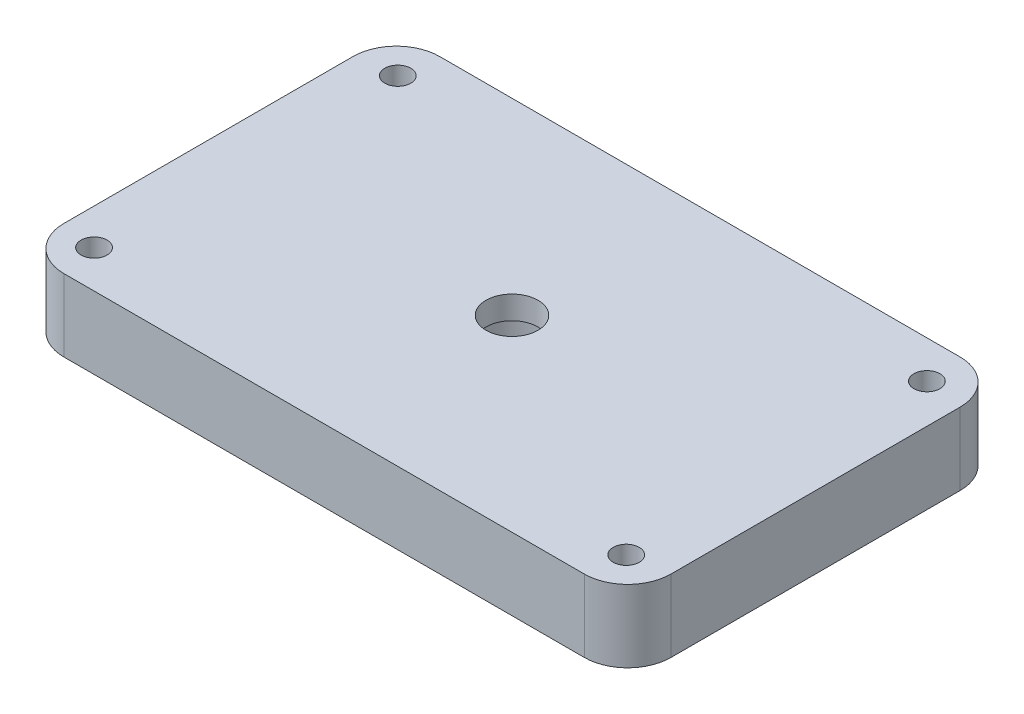
ISO-10303-21;
HEADER;
FILE_DESCRIPTION(('STEP AP214'),'2;1');
FILE_NAME('part.step','',(''),(''),'','','');
FILE_SCHEMA(('AUTOMOTIVE_DESIGN { 1 0 10303 214 1 1 1 1 }'));
ENDSEC;
DATA;
#1=APPLICATION_CONTEXT('core data for automotive mechanical design processes');
#2=APPLICATION_PROTOCOL_DEFINITION('international standard','automotive_design',2000,#1);
#3=PRODUCT_CONTEXT('',#1,'mechanical');
#4=PRODUCT('Part','Part','',(#3));
#5=PRODUCT_RELATED_PRODUCT_CATEGORY('part','',(#4));
#6=PRODUCT_DEFINITION_FORMATION('','',#4);
#7=PRODUCT_DEFINITION_CONTEXT('part definition',#1,'design');
#8=PRODUCT_DEFINITION('design','',#6,#7);
#9=PRODUCT_DEFINITION_SHAPE('','',#8);
#10=(LENGTH_UNIT() NAMED_UNIT(*) SI_UNIT(.MILLI.,.METRE.));
#11=(NAMED_UNIT(*) PLANE_ANGLE_UNIT() SI_UNIT($,.RADIAN.));
#12=(NAMED_UNIT(*) SI_UNIT($,.STERADIAN.) SOLID_ANGLE_UNIT());
#13=UNCERTAINTY_MEASURE_WITH_UNIT(LENGTH_MEASURE(1.E-05),#10,'distance_accuracy_value','');
#14=(GEOMETRIC_REPRESENTATION_CONTEXT(3) GLOBAL_UNCERTAINTY_ASSIGNED_CONTEXT((#13)) GLOBAL_UNIT_ASSIGNED_CONTEXT((#10,
#11,#12)) REPRESENTATION_CONTEXT('',''));
#15=CARTESIAN_POINT('',(0.,0.,0.));
#16=DIRECTION('',(0.,0.,1.));
#17=DIRECTION('',(1.,0.,0.));
#18=AXIS2_PLACEMENT_3D('',#15,#16,#17);
#19=CARTESIAN_POINT('',(-22.86,6.35,-12.7));
#20=DIRECTION('',(0.,1.,0.));
#21=DIRECTION('',(0.,0.,1.));
#22=AXIS2_PLACEMENT_3D('',#19,#20,#21);
#23=PLANE('',#22);
#24=CARTESIAN_POINT('',(0.,6.35,0.));
#25=DIRECTION('',(0.,1.,0.));
#26=DIRECTION('',(0.,0.,1.));
#27=AXIS2_PLACEMENT_3D('',#24,#25,#26);
#28=CIRCLE('',#27,2.286);
#29=CARTESIAN_POINT('',(0.,6.35,2.286));
#30=VERTEX_POINT('',#29);
#31=EDGE_CURVE('E208',#30,#30,#28,.T.);
#32=ORIENTED_EDGE('',*,*,#31,.F.);
#33=EDGE_LOOP('',(#32));
#34=FACE_BOUND('',#33,.T.);
#35=CARTESIAN_POINT('',(23.241,6.35,13.208));
#36=DIRECTION('',(0.,1.,0.));
#37=DIRECTION('',(0.,0.,1.));
#38=AXIS2_PLACEMENT_3D('',#35,#36,#37);
#39=CIRCLE('',#38,1.14299999999999);
#40=CARTESIAN_POINT('',(23.241,6.35,14.351));
#41=VERTEX_POINT('',#40);
#42=EDGE_CURVE('E190',#41,#41,#39,.T.);
#43=ORIENTED_EDGE('',*,*,#42,.F.);
#44=EDGE_LOOP('',(#43));
#45=FACE_BOUND('',#44,.T.);
#46=CARTESIAN_POINT('',(-23.241,6.35,-13.208));
#47=DIRECTION('',(0.,1.,0.));
#48=DIRECTION('',(0.,0.,1.));
#49=AXIS2_PLACEMENT_3D('',#46,#47,#48);
#50=CIRCLE('',#49,1.143);
#51=CARTESIAN_POINT('',(-23.241,6.35,-12.065));
#52=VERTEX_POINT('',#51);
#53=EDGE_CURVE('E136',#52,#52,#50,.T.);
#54=ORIENTED_EDGE('',*,*,#53,.F.);
#55=EDGE_LOOP('',(#54));
#56=FACE_BOUND('',#55,.T.);
#57=CARTESIAN_POINT('',(-22.86,6.35,-12.7));
#58=DIRECTION('',(0.,1.,0.));
#59=DIRECTION('',(0.,0.,1.));
#60=AXIS2_PLACEMENT_3D('',#57,#58,#59);
#61=CIRCLE('',#60,3.81);
#62=CARTESIAN_POINT('',(-22.86,6.35,-16.51));
#63=VERTEX_POINT('',#62);
#64=CARTESIAN_POINT('',(-26.67,6.35,-12.7));
#65=VERTEX_POINT('',#64);
#66=EDGE_CURVE('E148',#63,#65,#61,.T.);
#67=ORIENTED_EDGE('',*,*,#66,.T.);
#68=DIRECTION('',(0.,0.,1.));
#69=VECTOR('',#68,1.);
#70=CARTESIAN_POINT('',(-26.67,6.35,-12.7));
#71=LINE('',#70,#69);
#72=CARTESIAN_POINT('',(-26.67,6.35,12.7));
#73=VERTEX_POINT('',#72);
#74=EDGE_CURVE('E95',#65,#73,#71,.T.);
#75=ORIENTED_EDGE('',*,*,#74,.T.);
#76=CARTESIAN_POINT('',(-22.86,6.35,12.7));
#77=DIRECTION('',(0.,1.,0.));
#78=DIRECTION('',(0.,0.,1.));
#79=AXIS2_PLACEMENT_3D('',#76,#77,#78);
#80=CIRCLE('',#79,3.81);
#81=CARTESIAN_POINT('',(-22.86,6.35,16.51));
#82=VERTEX_POINT('',#81);
#83=EDGE_CURVE('E163',#73,#82,#80,.T.);
#84=ORIENTED_EDGE('',*,*,#83,.T.);
#85=DIRECTION('',(1.,0.,0.));
#86=VECTOR('',#85,1.);
#87=CARTESIAN_POINT('',(-22.86,6.35,16.51));
#88=LINE('',#87,#86);
#89=CARTESIAN_POINT('',(22.86,6.35,16.51));
#90=VERTEX_POINT('',#89);
#91=EDGE_CURVE('E175',#82,#90,#88,.T.);
#92=ORIENTED_EDGE('',*,*,#91,.T.);
#93=CARTESIAN_POINT('',(22.86,6.35,12.7));
#94=DIRECTION('',(0.,1.,0.));
#95=DIRECTION('',(0.,0.,1.));
#96=AXIS2_PLACEMENT_3D('',#93,#94,#95);
#97=CIRCLE('',#96,3.81);
#98=CARTESIAN_POINT('',(26.67,6.35,12.7));
#99=VERTEX_POINT('',#98);
#100=EDGE_CURVE('E114',#90,#99,#97,.T.);
#101=ORIENTED_EDGE('',*,*,#100,.T.);
#102=DIRECTION('',(0.,0.,-1.));
#103=VECTOR('',#102,1.);
#104=CARTESIAN_POINT('',(26.67,6.35,-12.7));
#105=LINE('',#104,#103);
#106=CARTESIAN_POINT('',(26.67,6.35,-12.7));
#107=VERTEX_POINT('',#106);
#108=EDGE_CURVE('E108',#99,#107,#105,.T.);
#109=ORIENTED_EDGE('',*,*,#108,.T.);
#110=CARTESIAN_POINT('',(22.86,6.35,-12.7));
#111=DIRECTION('',(0.,1.,0.));
#112=DIRECTION('',(0.,0.,-1.));
#113=AXIS2_PLACEMENT_3D('',#110,#111,#112);
#114=CIRCLE('',#113,3.81);
#115=CARTESIAN_POINT('',(22.86,6.35,-16.51));
#116=VERTEX_POINT('',#115);
#117=EDGE_CURVE('E112',#107,#116,#114,.T.);
#118=ORIENTED_EDGE('',*,*,#117,.T.);
#119=DIRECTION('',(-1.,0.,0.));
#120=VECTOR('',#119,1.);
#121=CARTESIAN_POINT('',(-22.86,6.35,-16.51));
#122=LINE('',#121,#120);
#123=EDGE_CURVE('E52',#116,#63,#122,.T.);
#124=ORIENTED_EDGE('',*,*,#123,.T.);
#125=EDGE_LOOP('',(#67,#75,#84,#92,#101,#109,#118,#124));
#126=FACE_BOUND('',#125,.T.);
#127=CARTESIAN_POINT('',(23.241,6.35,-13.208));
#128=DIRECTION('',(0.,1.,0.));
#129=DIRECTION('',(0.,0.,1.));
#130=AXIS2_PLACEMENT_3D('',#127,#128,#129);
#131=CIRCLE('',#130,1.143);
#132=CARTESIAN_POINT('',(23.241,6.35,-12.065));
#133=VERTEX_POINT('',#132);
#134=EDGE_CURVE('E184',#133,#133,#131,.T.);
#135=ORIENTED_EDGE('',*,*,#134,.F.);
#136=EDGE_LOOP('',(#135));
#137=FACE_BOUND('',#136,.T.);
#138=CARTESIAN_POINT('',(-23.5075398103486,6.35,13.208));
#139=DIRECTION('',(0.,1.,0.));
#140=DIRECTION('',(0.,0.,1.));
#141=AXIS2_PLACEMENT_3D('',#138,#139,#140);
#142=CIRCLE('',#141,1.143);
#143=CARTESIAN_POINT('',(-23.5075398103486,6.35,14.351));
#144=VERTEX_POINT('',#143);
#145=EDGE_CURVE('E196',#144,#144,#142,.T.);
#146=ORIENTED_EDGE('',*,*,#145,.F.);
#147=EDGE_LOOP('',(#146));
#148=FACE_BOUND('',#147,.T.);
#149=ADVANCED_FACE('F35',(#34,#45,#56,#126,#137,#148),#23,.T.);
#150=CARTESIAN_POINT('',(-22.86,0.,-12.7));
#151=DIRECTION('',(0.,1.,0.));
#152=DIRECTION('',(0.,0.,1.));
#153=AXIS2_PLACEMENT_3D('',#150,#151,#152);
#154=PLANE('',#153);
#155=CARTESIAN_POINT('',(0.,0.,0.));
#156=DIRECTION('',(0.,-1.,0.));
#157=DIRECTION('',(0.,0.,-1.));
#158=AXIS2_PLACEMENT_3D('',#155,#156,#157);
#159=CIRCLE('',#158,3.81);
#160=CARTESIAN_POINT('',(0.,0.,-3.81));
#161=VERTEX_POINT('',#160);
#162=EDGE_CURVE('E205',#161,#161,#159,.T.);
#163=ORIENTED_EDGE('',*,*,#162,.F.);
#164=EDGE_LOOP('',(#163));
#165=FACE_BOUND('',#164,.T.);
#166=CARTESIAN_POINT('',(-22.86,0.,-12.7));
#167=DIRECTION('',(0.,1.,0.));
#168=DIRECTION('',(0.,0.,1.));
#169=AXIS2_PLACEMENT_3D('',#166,#167,#168);
#170=CIRCLE('',#169,3.81);
#171=CARTESIAN_POINT('',(-22.86,0.,-16.51));
#172=VERTEX_POINT('',#171);
#173=CARTESIAN_POINT('',(-26.67,0.,-12.7));
#174=VERTEX_POINT('',#173);
#175=EDGE_CURVE('E132',#172,#174,#170,.T.);
#176=ORIENTED_EDGE('',*,*,#175,.F.);
#177=DIRECTION('',(-1.,0.,0.));
#178=VECTOR('',#177,1.);
#179=CARTESIAN_POINT('',(-22.86,0.,-16.51));
#180=LINE('',#179,#178);
#181=CARTESIAN_POINT('',(22.86,0.,-16.51));
#182=VERTEX_POINT('',#181);
#183=EDGE_CURVE('E87',#182,#172,#180,.T.);
#184=ORIENTED_EDGE('',*,*,#183,.F.);
#185=CARTESIAN_POINT('',(22.86,0.,-12.7));
#186=DIRECTION('',(0.,1.,0.));
#187=DIRECTION('',(0.,0.,-1.));
#188=AXIS2_PLACEMENT_3D('',#185,#186,#187);
#189=CIRCLE('',#188,3.81);
#190=CARTESIAN_POINT('',(26.67,0.,-12.7));
#191=VERTEX_POINT('',#190);
#192=EDGE_CURVE('E81',#191,#182,#189,.T.);
#193=ORIENTED_EDGE('',*,*,#192,.F.);
#194=DIRECTION('',(0.,0.,-1.));
#195=VECTOR('',#194,1.);
#196=CARTESIAN_POINT('',(26.67,0.,-12.7));
#197=LINE('',#196,#195);
#198=CARTESIAN_POINT('',(26.67,0.,12.7));
#199=VERTEX_POINT('',#198);
#200=EDGE_CURVE('E122',#199,#191,#197,.T.);
#201=ORIENTED_EDGE('',*,*,#200,.F.);
#202=CARTESIAN_POINT('',(22.86,0.,12.7));
#203=DIRECTION('',(0.,1.,0.));
#204=DIRECTION('',(0.,0.,1.));
#205=AXIS2_PLACEMENT_3D('',#202,#203,#204);
#206=CIRCLE('',#205,3.81);
#207=CARTESIAN_POINT('',(22.86,0.,16.51));
#208=VERTEX_POINT('',#207);
#209=EDGE_CURVE('E143',#208,#199,#206,.T.);
#210=ORIENTED_EDGE('',*,*,#209,.F.);
#211=DIRECTION('',(1.,0.,0.));
#212=VECTOR('',#211,1.);
#213=CARTESIAN_POINT('',(18.7325,0.,16.51));
#214=LINE('',#213,#212);
#215=CARTESIAN_POINT('',(-22.86,0.,16.51));
#216=VERTEX_POINT('',#215);
#217=EDGE_CURVE('E141',#216,#208,#214,.T.);
#218=ORIENTED_EDGE('',*,*,#217,.F.);
#219=CARTESIAN_POINT('',(-22.86,0.,12.7));
#220=DIRECTION('',(0.,1.,0.));
#221=DIRECTION('',(0.,0.,1.));
#222=AXIS2_PLACEMENT_3D('',#219,#220,#221);
#223=CIRCLE('',#222,3.81);
#224=CARTESIAN_POINT('',(-26.67,0.,12.7));
#225=VERTEX_POINT('',#224);
#226=EDGE_CURVE('E138',#225,#216,#223,.T.);
#227=ORIENTED_EDGE('',*,*,#226,.F.);
#228=DIRECTION('',(0.,0.,1.));
#229=VECTOR('',#228,1.);
#230=CARTESIAN_POINT('',(-26.67,0.,-12.7));
#231=LINE('',#230,#229);
#232=EDGE_CURVE('E135',#174,#225,#231,.T.);
#233=ORIENTED_EDGE('',*,*,#232,.F.);
#234=EDGE_LOOP('',(#176,#184,#193,#201,#210,#218,#227,#233));
#235=FACE_BOUND('',#234,.T.);
#236=CARTESIAN_POINT('',(-23.241,0.,-13.208));
#237=DIRECTION('',(0.,1.,0.));
#238=DIRECTION('',(0.,0.,1.));
#239=AXIS2_PLACEMENT_3D('',#236,#237,#238);
#240=CIRCLE('',#239,1.143);
#241=CARTESIAN_POINT('',(-23.241,0.,-12.065));
#242=VERTEX_POINT('',#241);
#243=EDGE_CURVE('E181',#242,#242,#240,.T.);
#244=ORIENTED_EDGE('',*,*,#243,.T.);
#245=EDGE_LOOP('',(#244));
#246=FACE_BOUND('',#245,.T.);
#247=CARTESIAN_POINT('',(23.241,0.,-13.208));
#248=DIRECTION('',(0.,1.,0.));
#249=DIRECTION('',(0.,0.,1.));
#250=AXIS2_PLACEMENT_3D('',#247,#248,#249);
#251=CIRCLE('',#250,1.143);
#252=CARTESIAN_POINT('',(23.241,0.,-12.065));
#253=VERTEX_POINT('',#252);
#254=EDGE_CURVE('E187',#253,#253,#251,.T.);
#255=ORIENTED_EDGE('',*,*,#254,.T.);
#256=EDGE_LOOP('',(#255));
#257=FACE_BOUND('',#256,.T.);
#258=CARTESIAN_POINT('',(23.241,0.,13.208));
#259=DIRECTION('',(0.,1.,0.));
#260=DIRECTION('',(0.,0.,1.));
#261=AXIS2_PLACEMENT_3D('',#258,#259,#260);
#262=CIRCLE('',#261,1.14299999999999);
#263=CARTESIAN_POINT('',(23.241,0.,14.351));
#264=VERTEX_POINT('',#263);
#265=EDGE_CURVE('E193',#264,#264,#262,.T.);
#266=ORIENTED_EDGE('',*,*,#265,.T.);
#267=EDGE_LOOP('',(#266));
#268=FACE_BOUND('',#267,.T.);
#269=CARTESIAN_POINT('',(-23.5075398103486,0.,13.208));
#270=DIRECTION('',(0.,1.,0.));
#271=DIRECTION('',(0.,0.,1.));
#272=AXIS2_PLACEMENT_3D('',#269,#270,#271);
#273=CIRCLE('',#272,1.143);
#274=CARTESIAN_POINT('',(-23.5075398103486,0.,14.351));
#275=VERTEX_POINT('',#274);
#276=EDGE_CURVE('E199',#275,#275,#273,.T.);
#277=ORIENTED_EDGE('',*,*,#276,.T.);
#278=EDGE_LOOP('',(#277));
#279=FACE_BOUND('',#278,.T.);
#280=ADVANCED_FACE('F166',(#165,#235,#246,#257,#268,#279),#154,.F.);
#281=CARTESIAN_POINT('',(-22.86,6.35,-12.7));
#282=DIRECTION('',(0.,-1.,0.));
#283=DIRECTION('',(0.,0.,-1.));
#284=AXIS2_PLACEMENT_3D('',#281,#282,#283);
#285=CYLINDRICAL_SURFACE('',#284,3.81);
#286=ORIENTED_EDGE('',*,*,#175,.T.);
#287=DIRECTION('',(0.,-1.,0.));
#288=VECTOR('',#287,1.);
#289=CARTESIAN_POINT('',(-26.67,6.35,-12.7));
#290=LINE('',#289,#288);
#291=EDGE_CURVE('E11',#65,#174,#290,.T.);
#292=ORIENTED_EDGE('',*,*,#291,.F.);
#293=ORIENTED_EDGE('',*,*,#66,.F.);
#294=DIRECTION('',(0.,-1.,0.));
#295=VECTOR('',#294,1.);
#296=CARTESIAN_POINT('',(-22.86,6.35,-16.51));
#297=LINE('',#296,#295);
#298=EDGE_CURVE('E128',#63,#172,#297,.T.);
#299=ORIENTED_EDGE('',*,*,#298,.T.);
#300=EDGE_LOOP('',(#286,#292,#293,#299));
#301=FACE_BOUND('',#300,.T.);
#302=ADVANCED_FACE('F37',(#301),#285,.T.);
#303=CARTESIAN_POINT('',(-26.67,6.35,-12.7));
#304=DIRECTION('',(1.,0.,0.));
#305=DIRECTION('',(0.,0.,-1.));
#306=AXIS2_PLACEMENT_3D('',#303,#304,#305);
#307=PLANE('',#306);
#308=ORIENTED_EDGE('',*,*,#232,.T.);
#309=DIRECTION('',(0.,-1.,0.));
#310=VECTOR('',#309,1.);
#311=CARTESIAN_POINT('',(-26.67,6.35,12.7));
#312=LINE('',#311,#310);
#313=EDGE_CURVE('E44',#73,#225,#312,.T.);
#314=ORIENTED_EDGE('',*,*,#313,.F.);
#315=ORIENTED_EDGE('',*,*,#74,.F.);
#316=ORIENTED_EDGE('',*,*,#291,.T.);
#317=EDGE_LOOP('',(#308,#314,#315,#316));
#318=FACE_BOUND('',#317,.T.);
#319=ADVANCED_FACE('F238',(#318),#307,.F.);
#320=CARTESIAN_POINT('',(-22.86,6.35,12.7));
#321=DIRECTION('',(0.,-1.,0.));
#322=DIRECTION('',(0.,0.,-1.));
#323=AXIS2_PLACEMENT_3D('',#320,#321,#322);
#324=CYLINDRICAL_SURFACE('',#323,3.81);
#325=ORIENTED_EDGE('',*,*,#226,.T.);
#326=DIRECTION('',(0.,-1.,0.));
#327=VECTOR('',#326,1.);
#328=CARTESIAN_POINT('',(-22.86,6.35,16.51));
#329=LINE('',#328,#327);
#330=EDGE_CURVE('E155',#82,#216,#329,.T.);
#331=ORIENTED_EDGE('',*,*,#330,.F.);
#332=ORIENTED_EDGE('',*,*,#83,.F.);
#333=ORIENTED_EDGE('',*,*,#313,.T.);
#334=EDGE_LOOP('',(#325,#331,#332,#333));
#335=FACE_BOUND('',#334,.T.);
#336=ADVANCED_FACE('F161',(#335),#324,.T.);
#337=CARTESIAN_POINT('',(18.7325,6.35,16.51));
#338=DIRECTION('',(0.,0.,-1.));
#339=DIRECTION('',(-1.,0.,0.));
#340=AXIS2_PLACEMENT_3D('',#337,#338,#339);
#341=PLANE('',#340);
#342=ORIENTED_EDGE('',*,*,#217,.T.);
#343=DIRECTION('',(0.,-1.,0.));
#344=VECTOR('',#343,1.);
#345=CARTESIAN_POINT('',(22.86,6.35,16.51));
#346=LINE('',#345,#344);
#347=EDGE_CURVE('E152',#90,#208,#346,.T.);
#348=ORIENTED_EDGE('',*,*,#347,.F.);
#349=ORIENTED_EDGE('',*,*,#91,.F.);
#350=ORIENTED_EDGE('',*,*,#330,.T.);
#351=EDGE_LOOP('',(#342,#348,#349,#350));
#352=FACE_BOUND('',#351,.T.);
#353=ADVANCED_FACE('F171',(#352),#341,.F.);
#354=CARTESIAN_POINT('',(22.86,6.35,12.7));
#355=DIRECTION('',(0.,-1.,0.));
#356=DIRECTION('',(0.,0.,-1.));
#357=AXIS2_PLACEMENT_3D('',#354,#355,#356);
#358=CYLINDRICAL_SURFACE('',#357,3.81);
#359=ORIENTED_EDGE('',*,*,#209,.T.);
#360=DIRECTION('',(0.,-1.,0.));
#361=VECTOR('',#360,1.);
#362=CARTESIAN_POINT('',(26.67,6.35,12.7));
#363=LINE('',#362,#361);
#364=EDGE_CURVE('E123',#99,#199,#363,.T.);
#365=ORIENTED_EDGE('',*,*,#364,.F.);
#366=ORIENTED_EDGE('',*,*,#100,.F.);
#367=ORIENTED_EDGE('',*,*,#347,.T.);
#368=EDGE_LOOP('',(#359,#365,#366,#367));
#369=FACE_BOUND('',#368,.T.);
#370=ADVANCED_FACE('F174',(#369),#358,.T.);
#371=CARTESIAN_POINT('',(26.67,6.35,-12.7));
#372=DIRECTION('',(-1.,0.,0.));
#373=DIRECTION('',(0.,0.,1.));
#374=AXIS2_PLACEMENT_3D('',#371,#372,#373);
#375=PLANE('',#374);
#376=ORIENTED_EDGE('',*,*,#200,.T.);
#377=DIRECTION('',(0.,-1.,0.));
#378=VECTOR('',#377,1.);
#379=CARTESIAN_POINT('',(26.67,6.35,-12.7));
#380=LINE('',#379,#378);
#381=EDGE_CURVE('E119',#107,#191,#380,.T.);
#382=ORIENTED_EDGE('',*,*,#381,.F.);
#383=ORIENTED_EDGE('',*,*,#108,.F.);
#384=ORIENTED_EDGE('',*,*,#364,.T.);
#385=EDGE_LOOP('',(#376,#382,#383,#384));
#386=FACE_BOUND('',#385,.T.);
#387=ADVANCED_FACE('F120',(#386),#375,.F.);
#388=CARTESIAN_POINT('',(22.86,6.35,-12.7));
#389=DIRECTION('',(0.,-1.,0.));
#390=DIRECTION('',(0.,0.,-1.));
#391=AXIS2_PLACEMENT_3D('',#388,#389,#390);
#392=CYLINDRICAL_SURFACE('',#391,3.81);
#393=ORIENTED_EDGE('',*,*,#192,.T.);
#394=DIRECTION('',(0.,-1.,0.));
#395=VECTOR('',#394,1.);
#396=CARTESIAN_POINT('',(22.86,6.35,-16.51));
#397=LINE('',#396,#395);
#398=EDGE_CURVE('E124',#116,#182,#397,.T.);
#399=ORIENTED_EDGE('',*,*,#398,.F.);
#400=ORIENTED_EDGE('',*,*,#117,.F.);
#401=ORIENTED_EDGE('',*,*,#381,.T.);
#402=EDGE_LOOP('',(#393,#399,#400,#401));
#403=FACE_BOUND('',#402,.T.);
#404=ADVANCED_FACE('F126',(#403),#392,.T.);
#405=CARTESIAN_POINT('',(-22.86,6.35,-16.51));
#406=DIRECTION('',(0.,0.,1.));
#407=DIRECTION('',(1.,0.,0.));
#408=AXIS2_PLACEMENT_3D('',#405,#406,#407);
#409=PLANE('',#408);
#410=ORIENTED_EDGE('',*,*,#183,.T.);
#411=ORIENTED_EDGE('',*,*,#298,.F.);
#412=ORIENTED_EDGE('',*,*,#123,.F.);
#413=ORIENTED_EDGE('',*,*,#398,.T.);
#414=EDGE_LOOP('',(#410,#411,#412,#413));
#415=FACE_BOUND('',#414,.T.);
#416=ADVANCED_FACE('F244',(#415),#409,.F.);
#417=CARTESIAN_POINT('',(-23.241,6.35,-13.208));
#418=DIRECTION('',(0.,-1.,0.));
#419=DIRECTION('',(0.,0.,-1.));
#420=AXIS2_PLACEMENT_3D('',#417,#418,#419);
#421=CYLINDRICAL_SURFACE('',#420,1.143);
#422=ORIENTED_EDGE('',*,*,#53,.T.);
#423=EDGE_LOOP('',(#422));
#424=FACE_BOUND('',#423,.T.);
#425=ORIENTED_EDGE('',*,*,#243,.F.);
#426=EDGE_LOOP('',(#425));
#427=FACE_BOUND('',#426,.T.);
#428=ADVANCED_FACE('F247',(#424,#427),#421,.F.);
#429=CARTESIAN_POINT('',(23.241,6.35,-13.208));
#430=DIRECTION('',(0.,-1.,0.));
#431=DIRECTION('',(0.,0.,-1.));
#432=AXIS2_PLACEMENT_3D('',#429,#430,#431);
#433=CYLINDRICAL_SURFACE('',#432,1.143);
#434=ORIENTED_EDGE('',*,*,#134,.T.);
#435=EDGE_LOOP('',(#434));
#436=FACE_BOUND('',#435,.T.);
#437=ORIENTED_EDGE('',*,*,#254,.F.);
#438=EDGE_LOOP('',(#437));
#439=FACE_BOUND('',#438,.T.);
#440=ADVANCED_FACE('F294',(#436,#439),#433,.F.);
#441=CARTESIAN_POINT('',(23.241,6.35,13.208));
#442=DIRECTION('',(0.,-1.,0.));
#443=DIRECTION('',(0.,0.,-1.));
#444=AXIS2_PLACEMENT_3D('',#441,#442,#443);
#445=CYLINDRICAL_SURFACE('',#444,1.14299999999999);
#446=ORIENTED_EDGE('',*,*,#42,.T.);
#447=EDGE_LOOP('',(#446));
#448=FACE_BOUND('',#447,.T.);
#449=ORIENTED_EDGE('',*,*,#265,.F.);
#450=EDGE_LOOP('',(#449));
#451=FACE_BOUND('',#450,.T.);
#452=ADVANCED_FACE('F301',(#448,#451),#445,.F.);
#453=CARTESIAN_POINT('',(-23.5075398103486,6.35,13.208));
#454=DIRECTION('',(0.,-1.,0.));
#455=DIRECTION('',(0.,0.,-1.));
#456=AXIS2_PLACEMENT_3D('',#453,#454,#455);
#457=CYLINDRICAL_SURFACE('',#456,1.143);
#458=ORIENTED_EDGE('',*,*,#145,.T.);
#459=EDGE_LOOP('',(#458));
#460=FACE_BOUND('',#459,.T.);
#461=ORIENTED_EDGE('',*,*,#276,.F.);
#462=EDGE_LOOP('',(#461));
#463=FACE_BOUND('',#462,.T.);
#464=ADVANCED_FACE('F228',(#460,#463),#457,.F.);
#465=CARTESIAN_POINT('',(0.,4.318,0.));
#466=DIRECTION('',(0.,-1.,0.));
#467=DIRECTION('',(0.,0.,-1.));
#468=AXIS2_PLACEMENT_3D('',#465,#466,#467);
#469=CYLINDRICAL_SURFACE('',#468,3.81);
#470=CARTESIAN_POINT('',(0.,4.318,0.));
#471=DIRECTION('',(0.,-1.,0.));
#472=DIRECTION('',(0.,0.,-1.));
#473=AXIS2_PLACEMENT_3D('',#470,#471,#472);
#474=CIRCLE('',#473,3.81);
#475=CARTESIAN_POINT('',(0.,4.318,-3.81));
#476=VERTEX_POINT('',#475);
#477=EDGE_CURVE('E202',#476,#476,#474,.T.);
#478=ORIENTED_EDGE('',*,*,#477,.F.);
#479=EDGE_LOOP('',(#478));
#480=FACE_BOUND('',#479,.T.);
#481=ORIENTED_EDGE('',*,*,#162,.T.);
#482=EDGE_LOOP('',(#481));
#483=FACE_BOUND('',#482,.T.);
#484=ADVANCED_FACE('F222',(#480,#483),#469,.F.);
#485=CARTESIAN_POINT('',(0.,4.318,0.));
#486=DIRECTION('',(0.,-1.,0.));
#487=DIRECTION('',(0.,0.,-1.));
#488=AXIS2_PLACEMENT_3D('',#485,#486,#487);
#489=PLANE('',#488);
#490=CARTESIAN_POINT('',(0.,4.318,0.));
#491=DIRECTION('',(0.,-1.,0.));
#492=DIRECTION('',(0.,0.,-1.));
#493=AXIS2_PLACEMENT_3D('',#490,#491,#492);
#494=CIRCLE('',#493,2.286);
#495=CARTESIAN_POINT('',(0.,4.318,-2.286));
#496=VERTEX_POINT('',#495);
#497=EDGE_CURVE('E213',#496,#496,#494,.T.);
#498=ORIENTED_EDGE('',*,*,#497,.F.);
#499=EDGE_LOOP('',(#498));
#500=FACE_BOUND('',#499,.T.);
#501=ORIENTED_EDGE('',*,*,#477,.T.);
#502=EDGE_LOOP('',(#501));
#503=FACE_BOUND('',#502,.T.);
#504=ADVANCED_FACE('F219',(#500,#503),#489,.T.);
#505=CARTESIAN_POINT('',(0.,8.636,0.));
#506=DIRECTION('',(0.,-1.,0.));
#507=DIRECTION('',(0.,0.,-1.));
#508=AXIS2_PLACEMENT_3D('',#505,#506,#507);
#509=CYLINDRICAL_SURFACE('',#508,2.286);
#510=ORIENTED_EDGE('',*,*,#31,.T.);
#511=EDGE_LOOP('',(#510));
#512=FACE_BOUND('',#511,.T.);
#513=ORIENTED_EDGE('',*,*,#497,.T.);
#514=EDGE_LOOP('',(#513));
#515=FACE_BOUND('',#514,.T.);
#516=ADVANCED_FACE('F217',(#512,#515),#509,.F.);
#517=CLOSED_SHELL('',(#149,#280,#302,#319,#336,#353,#370,#387,#404,#416,#428,#440,#452,#464,
#484,#504,#516));
#518=MANIFOLD_SOLID_BREP('B2',#517);
#519=ADVANCED_BREP_SHAPE_REPRESENTATION('',(#18,#518),#14);
#520=SHAPE_DEFINITION_REPRESENTATION(#9,#519);
ENDSEC;
END-ISO-10303-21;
